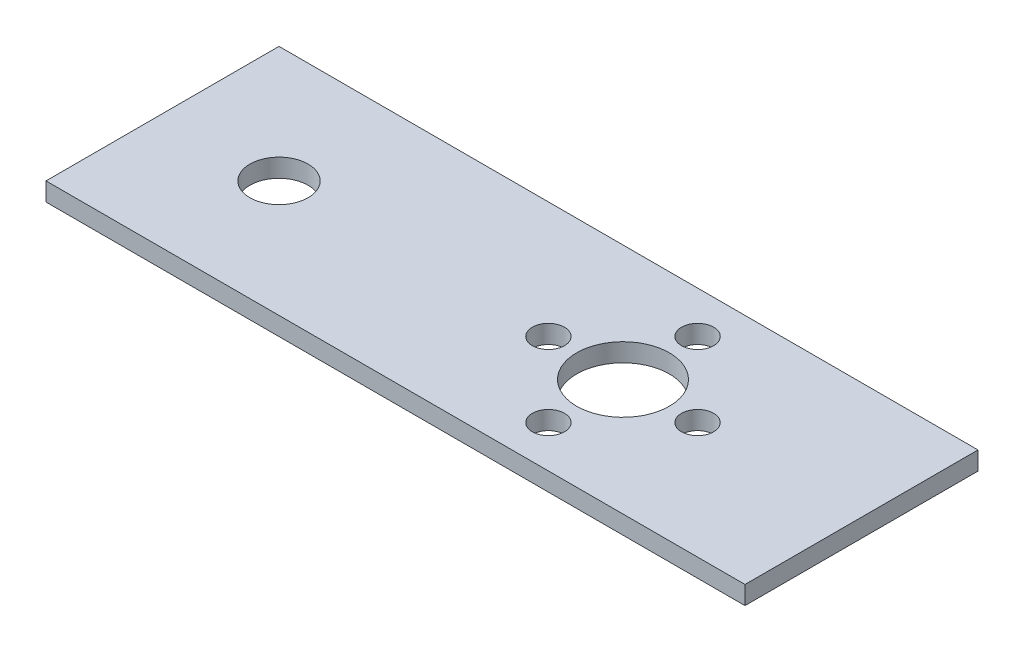
ISO-10303-21;
HEADER;
FILE_DESCRIPTION(('STEP AP214'),'2;1');
FILE_NAME('part.step','',(''),(''),'','','');
FILE_SCHEMA(('AUTOMOTIVE_DESIGN { 1 0 10303 214 1 1 1 1 }'));
ENDSEC;
DATA;
#1=APPLICATION_CONTEXT('core data for automotive mechanical design processes');
#2=APPLICATION_PROTOCOL_DEFINITION('international standard','automotive_design',2000,#1);
#3=PRODUCT_CONTEXT('',#1,'mechanical');
#4=PRODUCT('Part','Part','',(#3));
#5=PRODUCT_RELATED_PRODUCT_CATEGORY('part','',(#4));
#6=PRODUCT_DEFINITION_FORMATION('','',#4);
#7=PRODUCT_DEFINITION_CONTEXT('part definition',#1,'design');
#8=PRODUCT_DEFINITION('design','',#6,#7);
#9=PRODUCT_DEFINITION_SHAPE('','',#8);
#10=(LENGTH_UNIT() NAMED_UNIT(*) SI_UNIT(.MILLI.,.METRE.));
#11=(NAMED_UNIT(*) PLANE_ANGLE_UNIT() SI_UNIT($,.RADIAN.));
#12=(NAMED_UNIT(*) SI_UNIT($,.STERADIAN.) SOLID_ANGLE_UNIT());
#13=UNCERTAINTY_MEASURE_WITH_UNIT(LENGTH_MEASURE(1.E-05),#10,'distance_accuracy_value','');
#14=(GEOMETRIC_REPRESENTATION_CONTEXT(3) GLOBAL_UNCERTAINTY_ASSIGNED_CONTEXT((#13)) GLOBAL_UNIT_ASSIGNED_CONTEXT((#10,
#11,#12)) REPRESENTATION_CONTEXT('',''));
#15=CARTESIAN_POINT('',(0.,0.,0.));
#16=DIRECTION('',(0.,0.,1.));
#17=DIRECTION('',(1.,0.,0.));
#18=AXIS2_PLACEMENT_3D('',#15,#16,#17);
#19=CARTESIAN_POINT('',(0.,2.,0.));
#20=DIRECTION('',(0.,-1.,0.));
#21=DIRECTION('',(0.,0.,-1.));
#22=AXIS2_PLACEMENT_3D('',#19,#20,#21);
#23=PLANE('',#22);
#24=DIRECTION('',(0.,0.,-1.));
#25=VECTOR('',#24,1.);
#26=CARTESIAN_POINT('',(38.4,2.,12.7));
#27=LINE('',#26,#25);
#28=CARTESIAN_POINT('',(38.4,2.,12.7));
#29=VERTEX_POINT('',#28);
#30=CARTESIAN_POINT('',(38.4,2.,-12.7));
#31=VERTEX_POINT('',#30);
#32=EDGE_CURVE('E85',#29,#31,#27,.T.);
#33=ORIENTED_EDGE('',*,*,#32,.T.);
#34=DIRECTION('',(-1.,0.,0.));
#35=VECTOR('',#34,1.);
#36=CARTESIAN_POINT('',(-37.8,2.,-12.7));
#37=LINE('',#36,#35);
#38=CARTESIAN_POINT('',(-37.8,2.,-12.7));
#39=VERTEX_POINT('',#38);
#40=EDGE_CURVE('E80',#31,#39,#37,.T.);
#41=ORIENTED_EDGE('',*,*,#40,.T.);
#42=DIRECTION('',(0.,0.,1.));
#43=VECTOR('',#42,1.);
#44=CARTESIAN_POINT('',(-37.8,2.,12.7));
#45=LINE('',#44,#43);
#46=CARTESIAN_POINT('',(-37.8,2.,12.7));
#47=VERTEX_POINT('',#46);
#48=EDGE_CURVE('E83',#39,#47,#45,.T.);
#49=ORIENTED_EDGE('',*,*,#48,.T.);
#50=DIRECTION('',(1.,0.,0.));
#51=VECTOR('',#50,1.);
#52=CARTESIAN_POINT('',(-37.8,2.,12.7));
#53=LINE('',#52,#51);
#54=EDGE_CURVE('E50',#47,#29,#53,.T.);
#55=ORIENTED_EDGE('',*,*,#54,.T.);
#56=EDGE_LOOP('',(#33,#41,#49,#55));
#57=FACE_BOUND('',#56,.T.);
#58=CARTESIAN_POINT('',(12.4,2.,0.));
#59=DIRECTION('',(0.,1.,0.));
#60=DIRECTION('',(0.,0.,1.));
#61=AXIS2_PLACEMENT_3D('',#58,#59,#60);
#62=CIRCLE('',#61,5.05);
#63=CARTESIAN_POINT('',(12.4,2.,5.05));
#64=VERTEX_POINT('',#63);
#65=EDGE_CURVE('E100',#64,#64,#62,.T.);
#66=ORIENTED_EDGE('',*,*,#65,.F.);
#67=EDGE_LOOP('',(#66));
#68=FACE_BOUND('',#67,.T.);
#69=CARTESIAN_POINT('',(12.4,2.,-8.13));
#70=DIRECTION('',(0.,1.,0.));
#71=DIRECTION('',(0.,0.,1.));
#72=AXIS2_PLACEMENT_3D('',#69,#70,#71);
#73=CIRCLE('',#72,1.75);
#74=CARTESIAN_POINT('',(12.4,2.,-6.38));
#75=VERTEX_POINT('',#74);
#76=EDGE_CURVE('E115',#75,#75,#73,.T.);
#77=ORIENTED_EDGE('',*,*,#76,.F.);
#78=EDGE_LOOP('',(#77));
#79=FACE_BOUND('',#78,.T.);
#80=CARTESIAN_POINT('',(-25.1,2.,0.));
#81=DIRECTION('',(0.,1.,0.));
#82=DIRECTION('',(0.,0.,1.));
#83=AXIS2_PLACEMENT_3D('',#80,#81,#82);
#84=CIRCLE('',#83,3.175);
#85=CARTESIAN_POINT('',(-25.1,2.,3.175));
#86=VERTEX_POINT('',#85);
#87=EDGE_CURVE('E121',#86,#86,#84,.T.);
#88=ORIENTED_EDGE('',*,*,#87,.F.);
#89=EDGE_LOOP('',(#88));
#90=FACE_BOUND('',#89,.T.);
#91=CARTESIAN_POINT('',(20.5300000000001,2.,0.));
#92=DIRECTION('',(0.,1.,0.));
#93=DIRECTION('',(0.,0.,1.));
#94=AXIS2_PLACEMENT_3D('',#91,#92,#93);
#95=CIRCLE('',#94,1.75);
#96=CARTESIAN_POINT('',(20.5300000000001,2.,1.74999999999991));
#97=VERTEX_POINT('',#96);
#98=EDGE_CURVE('E127',#97,#97,#95,.T.);
#99=ORIENTED_EDGE('',*,*,#98,.F.);
#100=EDGE_LOOP('',(#99));
#101=FACE_BOUND('',#100,.T.);
#102=CARTESIAN_POINT('',(12.4000000000002,2.,8.13));
#103=DIRECTION('',(0.,1.,0.));
#104=DIRECTION('',(0.,0.,1.));
#105=AXIS2_PLACEMENT_3D('',#102,#103,#104);
#106=CIRCLE('',#105,1.75);
#107=CARTESIAN_POINT('',(12.4000000000002,2.,9.88));
#108=VERTEX_POINT('',#107);
#109=EDGE_CURVE('E133',#108,#108,#106,.T.);
#110=ORIENTED_EDGE('',*,*,#109,.F.);
#111=EDGE_LOOP('',(#110));
#112=FACE_BOUND('',#111,.T.);
#113=CARTESIAN_POINT('',(4.27000000000012,2.,0.));
#114=DIRECTION('',(0.,1.,0.));
#115=DIRECTION('',(0.,0.,1.));
#116=AXIS2_PLACEMENT_3D('',#113,#114,#115);
#117=CIRCLE('',#116,1.75);
#118=CARTESIAN_POINT('',(4.27000000000012,2.,1.75000000000003));
#119=VERTEX_POINT('',#118);
#120=EDGE_CURVE('E139',#119,#119,#117,.T.);
#121=ORIENTED_EDGE('',*,*,#120,.F.);
#122=EDGE_LOOP('',(#121));
#123=FACE_BOUND('',#122,.T.);
#124=ADVANCED_FACE('F33',(#57,#68,#79,#90,#101,#112,#123),#23,.F.);
#125=CARTESIAN_POINT('',(0.,0.,0.));
#126=DIRECTION('',(0.,-1.,0.));
#127=DIRECTION('',(0.,0.,-1.));
#128=AXIS2_PLACEMENT_3D('',#125,#126,#127);
#129=PLANE('',#128);
#130=CARTESIAN_POINT('',(12.4000000000002,0.,8.13));
#131=DIRECTION('',(0.,1.,0.));
#132=DIRECTION('',(0.,0.,1.));
#133=AXIS2_PLACEMENT_3D('',#130,#131,#132);
#134=CIRCLE('',#133,1.75);
#135=CARTESIAN_POINT('',(12.4000000000002,0.,9.88));
#136=VERTEX_POINT('',#135);
#137=EDGE_CURVE('E136',#136,#136,#134,.T.);
#138=ORIENTED_EDGE('',*,*,#137,.T.);
#139=EDGE_LOOP('',(#138));
#140=FACE_BOUND('',#139,.T.);
#141=CARTESIAN_POINT('',(-25.1,0.,0.));
#142=DIRECTION('',(0.,1.,0.));
#143=DIRECTION('',(0.,0.,1.));
#144=AXIS2_PLACEMENT_3D('',#141,#142,#143);
#145=CIRCLE('',#144,3.175);
#146=CARTESIAN_POINT('',(-25.1,0.,3.175));
#147=VERTEX_POINT('',#146);
#148=EDGE_CURVE('E124',#147,#147,#145,.T.);
#149=ORIENTED_EDGE('',*,*,#148,.T.);
#150=EDGE_LOOP('',(#149));
#151=FACE_BOUND('',#150,.T.);
#152=CARTESIAN_POINT('',(12.4,0.,0.));
#153=DIRECTION('',(0.,1.,0.));
#154=DIRECTION('',(0.,0.,1.));
#155=AXIS2_PLACEMENT_3D('',#152,#153,#154);
#156=CIRCLE('',#155,5.05);
#157=CARTESIAN_POINT('',(12.4,0.,5.05));
#158=VERTEX_POINT('',#157);
#159=EDGE_CURVE('E112',#158,#158,#156,.T.);
#160=ORIENTED_EDGE('',*,*,#159,.T.);
#161=EDGE_LOOP('',(#160));
#162=FACE_BOUND('',#161,.T.);
#163=DIRECTION('',(0.,0.,-1.));
#164=VECTOR('',#163,1.);
#165=CARTESIAN_POINT('',(38.4,0.,12.7));
#166=LINE('',#165,#164);
#167=CARTESIAN_POINT('',(38.4,0.,12.7));
#168=VERTEX_POINT('',#167);
#169=CARTESIAN_POINT('',(38.4,0.,-12.7));
#170=VERTEX_POINT('',#169);
#171=EDGE_CURVE('E97',#168,#170,#166,.T.);
#172=ORIENTED_EDGE('',*,*,#171,.F.);
#173=DIRECTION('',(1.,0.,0.));
#174=VECTOR('',#173,1.);
#175=CARTESIAN_POINT('',(-37.8,0.,12.7));
#176=LINE('',#175,#174);
#177=CARTESIAN_POINT('',(-37.8,0.,12.7));
#178=VERTEX_POINT('',#177);
#179=EDGE_CURVE('E73',#178,#168,#176,.T.);
#180=ORIENTED_EDGE('',*,*,#179,.F.);
#181=DIRECTION('',(0.,0.,1.));
#182=VECTOR('',#181,1.);
#183=CARTESIAN_POINT('',(-37.8,0.,12.7));
#184=LINE('',#183,#182);
#185=CARTESIAN_POINT('',(-37.8,0.,-12.7));
#186=VERTEX_POINT('',#185);
#187=EDGE_CURVE('E67',#186,#178,#184,.T.);
#188=ORIENTED_EDGE('',*,*,#187,.F.);
#189=DIRECTION('',(-1.,0.,0.));
#190=VECTOR('',#189,1.);
#191=CARTESIAN_POINT('',(-37.8,0.,-12.7));
#192=LINE('',#191,#190);
#193=EDGE_CURVE('E89',#170,#186,#192,.T.);
#194=ORIENTED_EDGE('',*,*,#193,.F.);
#195=EDGE_LOOP('',(#172,#180,#188,#194));
#196=FACE_BOUND('',#195,.T.);
#197=CARTESIAN_POINT('',(12.4,0.,-8.13));
#198=DIRECTION('',(0.,1.,0.));
#199=DIRECTION('',(0.,0.,1.));
#200=AXIS2_PLACEMENT_3D('',#197,#198,#199);
#201=CIRCLE('',#200,1.75);
#202=CARTESIAN_POINT('',(12.4,0.,-6.38));
#203=VERTEX_POINT('',#202);
#204=EDGE_CURVE('E118',#203,#203,#201,.T.);
#205=ORIENTED_EDGE('',*,*,#204,.T.);
#206=EDGE_LOOP('',(#205));
#207=FACE_BOUND('',#206,.T.);
#208=CARTESIAN_POINT('',(20.5300000000001,0.,0.));
#209=DIRECTION('',(0.,1.,0.));
#210=DIRECTION('',(0.,0.,1.));
#211=AXIS2_PLACEMENT_3D('',#208,#209,#210);
#212=CIRCLE('',#211,1.75);
#213=CARTESIAN_POINT('',(20.5300000000001,0.,1.74999999999991));
#214=VERTEX_POINT('',#213);
#215=EDGE_CURVE('E130',#214,#214,#212,.T.);
#216=ORIENTED_EDGE('',*,*,#215,.T.);
#217=EDGE_LOOP('',(#216));
#218=FACE_BOUND('',#217,.T.);
#219=CARTESIAN_POINT('',(4.27000000000012,0.,0.));
#220=DIRECTION('',(0.,1.,0.));
#221=DIRECTION('',(0.,0.,1.));
#222=AXIS2_PLACEMENT_3D('',#219,#220,#221);
#223=CIRCLE('',#222,1.75);
#224=CARTESIAN_POINT('',(4.27000000000012,0.,1.75000000000003));
#225=VERTEX_POINT('',#224);
#226=EDGE_CURVE('E142',#225,#225,#223,.T.);
#227=ORIENTED_EDGE('',*,*,#226,.T.);
#228=EDGE_LOOP('',(#227));
#229=FACE_BOUND('',#228,.T.);
#230=ADVANCED_FACE('F108',(#140,#151,#162,#196,#207,#218,#229),#129,.T.);
#231=CARTESIAN_POINT('',(38.4,2.,12.7));
#232=DIRECTION('',(-1.,0.,0.));
#233=DIRECTION('',(0.,0.,1.));
#234=AXIS2_PLACEMENT_3D('',#231,#232,#233);
#235=PLANE('',#234);
#236=ORIENTED_EDGE('',*,*,#171,.T.);
#237=DIRECTION('',(0.,-1.,0.));
#238=VECTOR('',#237,1.);
#239=CARTESIAN_POINT('',(38.4,2.,-12.7));
#240=LINE('',#239,#238);
#241=EDGE_CURVE('E11',#31,#170,#240,.T.);
#242=ORIENTED_EDGE('',*,*,#241,.F.);
#243=ORIENTED_EDGE('',*,*,#32,.F.);
#244=DIRECTION('',(0.,-1.,0.));
#245=VECTOR('',#244,1.);
#246=CARTESIAN_POINT('',(38.4,2.,12.7));
#247=LINE('',#246,#245);
#248=EDGE_CURVE('E93',#29,#168,#247,.T.);
#249=ORIENTED_EDGE('',*,*,#248,.T.);
#250=EDGE_LOOP('',(#236,#242,#243,#249));
#251=FACE_BOUND('',#250,.T.);
#252=ADVANCED_FACE('F35',(#251),#235,.F.);
#253=CARTESIAN_POINT('',(-37.8,2.,-12.7));
#254=DIRECTION('',(0.,0.,1.));
#255=DIRECTION('',(1.,0.,0.));
#256=AXIS2_PLACEMENT_3D('',#253,#254,#255);
#257=PLANE('',#256);
#258=ORIENTED_EDGE('',*,*,#193,.T.);
#259=DIRECTION('',(0.,-1.,0.));
#260=VECTOR('',#259,1.);
#261=CARTESIAN_POINT('',(-37.8,2.,-12.7));
#262=LINE('',#261,#260);
#263=EDGE_CURVE('E42',#39,#186,#262,.T.);
#264=ORIENTED_EDGE('',*,*,#263,.F.);
#265=ORIENTED_EDGE('',*,*,#40,.F.);
#266=ORIENTED_EDGE('',*,*,#241,.T.);
#267=EDGE_LOOP('',(#258,#264,#265,#266));
#268=FACE_BOUND('',#267,.T.);
#269=ADVANCED_FACE('F88',(#268),#257,.F.);
#270=CARTESIAN_POINT('',(-37.8,2.,12.7));
#271=DIRECTION('',(1.,0.,0.));
#272=DIRECTION('',(0.,0.,-1.));
#273=AXIS2_PLACEMENT_3D('',#270,#271,#272);
#274=PLANE('',#273);
#275=ORIENTED_EDGE('',*,*,#187,.T.);
#276=DIRECTION('',(0.,-1.,0.));
#277=VECTOR('',#276,1.);
#278=CARTESIAN_POINT('',(-37.8,2.,12.7));
#279=LINE('',#278,#277);
#280=EDGE_CURVE('E90',#47,#178,#279,.T.);
#281=ORIENTED_EDGE('',*,*,#280,.F.);
#282=ORIENTED_EDGE('',*,*,#48,.F.);
#283=ORIENTED_EDGE('',*,*,#263,.T.);
#284=EDGE_LOOP('',(#275,#281,#282,#283));
#285=FACE_BOUND('',#284,.T.);
#286=ADVANCED_FACE('F91',(#285),#274,.F.);
#287=CARTESIAN_POINT('',(-37.8,2.,12.7));
#288=DIRECTION('',(0.,0.,-1.));
#289=DIRECTION('',(-1.,0.,0.));
#290=AXIS2_PLACEMENT_3D('',#287,#288,#289);
#291=PLANE('',#290);
#292=ORIENTED_EDGE('',*,*,#179,.T.);
#293=ORIENTED_EDGE('',*,*,#248,.F.);
#294=ORIENTED_EDGE('',*,*,#54,.F.);
#295=ORIENTED_EDGE('',*,*,#280,.T.);
#296=EDGE_LOOP('',(#292,#293,#294,#295));
#297=FACE_BOUND('',#296,.T.);
#298=ADVANCED_FACE('F105',(#297),#291,.F.);
#299=CARTESIAN_POINT('',(12.4,2.,0.));
#300=DIRECTION('',(0.,-1.,0.));
#301=DIRECTION('',(0.,0.,-1.));
#302=AXIS2_PLACEMENT_3D('',#299,#300,#301);
#303=CYLINDRICAL_SURFACE('',#302,5.05);
#304=ORIENTED_EDGE('',*,*,#65,.T.);
#305=EDGE_LOOP('',(#304));
#306=FACE_BOUND('',#305,.T.);
#307=ORIENTED_EDGE('',*,*,#159,.F.);
#308=EDGE_LOOP('',(#307));
#309=FACE_BOUND('',#308,.T.);
#310=ADVANCED_FACE('F159',(#306,#309),#303,.F.);
#311=CARTESIAN_POINT('',(12.4,2.,-8.13));
#312=DIRECTION('',(0.,-1.,0.));
#313=DIRECTION('',(0.,0.,-1.));
#314=AXIS2_PLACEMENT_3D('',#311,#312,#313);
#315=CYLINDRICAL_SURFACE('',#314,1.75);
#316=ORIENTED_EDGE('',*,*,#76,.T.);
#317=EDGE_LOOP('',(#316));
#318=FACE_BOUND('',#317,.T.);
#319=ORIENTED_EDGE('',*,*,#204,.F.);
#320=EDGE_LOOP('',(#319));
#321=FACE_BOUND('',#320,.T.);
#322=ADVANCED_FACE('F205',(#318,#321),#315,.F.);
#323=CARTESIAN_POINT('',(-25.1,2.,0.));
#324=DIRECTION('',(0.,-1.,0.));
#325=DIRECTION('',(0.,0.,-1.));
#326=AXIS2_PLACEMENT_3D('',#323,#324,#325);
#327=CYLINDRICAL_SURFACE('',#326,3.175);
#328=ORIENTED_EDGE('',*,*,#87,.T.);
#329=EDGE_LOOP('',(#328));
#330=FACE_BOUND('',#329,.T.);
#331=ORIENTED_EDGE('',*,*,#148,.F.);
#332=EDGE_LOOP('',(#331));
#333=FACE_BOUND('',#332,.T.);
#334=ADVANCED_FACE('F213',(#330,#333),#327,.F.);
#335=CARTESIAN_POINT('',(20.5300000000001,2.,0.));
#336=DIRECTION('',(0.,-1.,0.));
#337=DIRECTION('',(0.,0.,-1.));
#338=AXIS2_PLACEMENT_3D('',#335,#336,#337);
#339=CYLINDRICAL_SURFACE('',#338,1.75);
#340=ORIENTED_EDGE('',*,*,#98,.T.);
#341=EDGE_LOOP('',(#340));
#342=FACE_BOUND('',#341,.T.);
#343=ORIENTED_EDGE('',*,*,#215,.F.);
#344=EDGE_LOOP('',(#343));
#345=FACE_BOUND('',#344,.T.);
#346=ADVANCED_FACE('F221',(#342,#345),#339,.F.);
#347=CARTESIAN_POINT('',(12.4000000000002,2.,8.13));
#348=DIRECTION('',(0.,-1.,0.));
#349=DIRECTION('',(0.,0.,-1.));
#350=AXIS2_PLACEMENT_3D('',#347,#348,#349);
#351=CYLINDRICAL_SURFACE('',#350,1.75);
#352=ORIENTED_EDGE('',*,*,#109,.T.);
#353=EDGE_LOOP('',(#352));
#354=FACE_BOUND('',#353,.T.);
#355=ORIENTED_EDGE('',*,*,#137,.F.);
#356=EDGE_LOOP('',(#355));
#357=FACE_BOUND('',#356,.T.);
#358=ADVANCED_FACE('F230',(#354,#357),#351,.F.);
#359=CARTESIAN_POINT('',(4.27000000000012,2.,0.));
#360=DIRECTION('',(0.,-1.,0.));
#361=DIRECTION('',(0.,0.,-1.));
#362=AXIS2_PLACEMENT_3D('',#359,#360,#361);
#363=CYLINDRICAL_SURFACE('',#362,1.75);
#364=ORIENTED_EDGE('',*,*,#120,.T.);
#365=EDGE_LOOP('',(#364));
#366=FACE_BOUND('',#365,.T.);
#367=ORIENTED_EDGE('',*,*,#226,.F.);
#368=EDGE_LOOP('',(#367));
#369=FACE_BOUND('',#368,.T.);
#370=ADVANCED_FACE('F148',(#366,#369),#363,.F.);
#371=CLOSED_SHELL('',(#124,#230,#252,#269,#286,#298,#310,#322,#334,#346,#358,#370));
#372=MANIFOLD_SOLID_BREP('B2',#371);
#373=ADVANCED_BREP_SHAPE_REPRESENTATION('',(#18,#372),#14);
#374=SHAPE_DEFINITION_REPRESENTATION(#9,#373);
ENDSEC;
END-ISO-10303-21;
